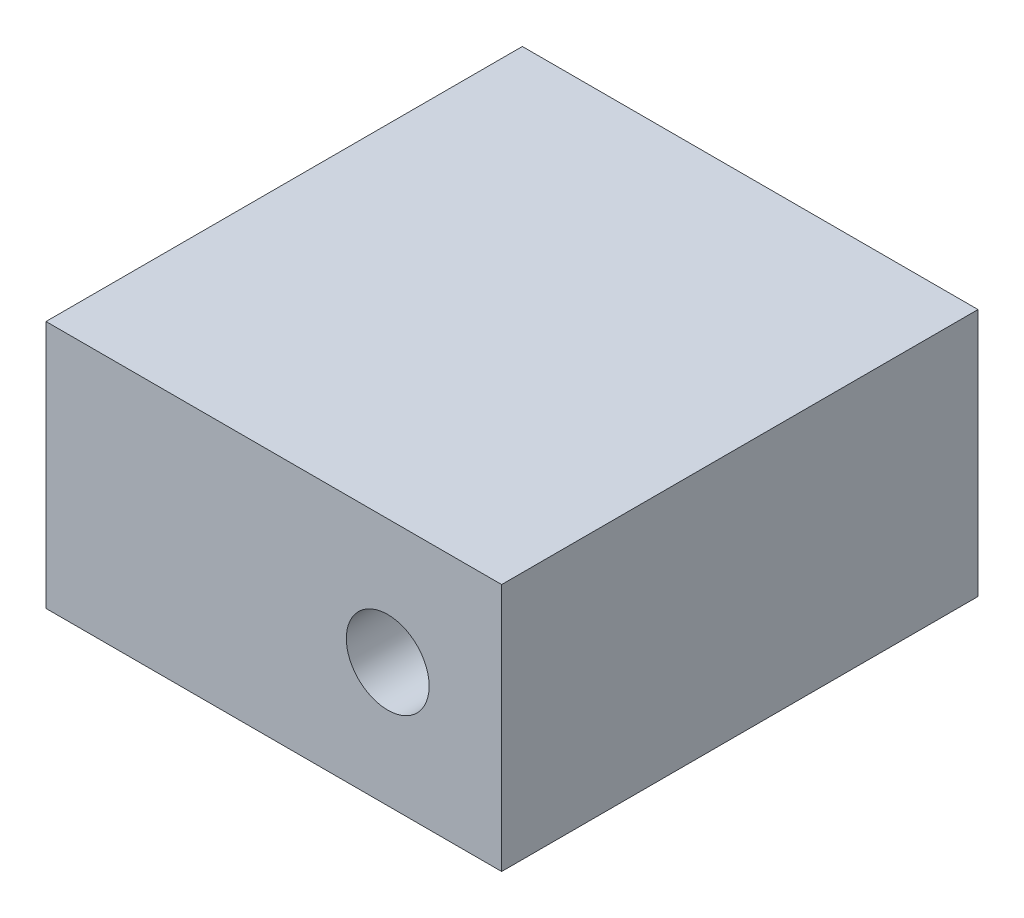
ISO-10303-21;
HEADER;
FILE_DESCRIPTION(('STEP AP214'),'2;1');
FILE_NAME('part.step','',(''),(''),'','','');
FILE_SCHEMA(('AUTOMOTIVE_DESIGN { 1 0 10303 214 1 1 1 1 }'));
ENDSEC;
DATA;
#1=APPLICATION_CONTEXT('core data for automotive mechanical design processes');
#2=APPLICATION_PROTOCOL_DEFINITION('international standard','automotive_design',2000,#1);
#3=PRODUCT_CONTEXT('',#1,'mechanical');
#4=PRODUCT('Part','Part','',(#3));
#5=PRODUCT_RELATED_PRODUCT_CATEGORY('part','',(#4));
#6=PRODUCT_DEFINITION_FORMATION('','',#4);
#7=PRODUCT_DEFINITION_CONTEXT('part definition',#1,'design');
#8=PRODUCT_DEFINITION('design','',#6,#7);
#9=PRODUCT_DEFINITION_SHAPE('','',#8);
#10=(LENGTH_UNIT() NAMED_UNIT(*) SI_UNIT(.MILLI.,.METRE.));
#11=(NAMED_UNIT(*) PLANE_ANGLE_UNIT() SI_UNIT($,.RADIAN.));
#12=(NAMED_UNIT(*) SI_UNIT($,.STERADIAN.) SOLID_ANGLE_UNIT());
#13=UNCERTAINTY_MEASURE_WITH_UNIT(LENGTH_MEASURE(1.E-05),#10,'distance_accuracy_value','');
#14=(GEOMETRIC_REPRESENTATION_CONTEXT(3) GLOBAL_UNCERTAINTY_ASSIGNED_CONTEXT((#13)) GLOBAL_UNIT_ASSIGNED_CONTEXT((#10,
#11,#12)) REPRESENTATION_CONTEXT('',''));
#15=CARTESIAN_POINT('',(0.,0.,0.));
#16=DIRECTION('',(0.,0.,1.));
#17=DIRECTION('',(1.,0.,0.));
#18=AXIS2_PLACEMENT_3D('',#15,#16,#17);
#19=CARTESIAN_POINT('',(0.,0.,23.));
#20=DIRECTION('',(1.,0.,0.));
#21=DIRECTION('',(0.,0.,-1.));
#22=AXIS2_PLACEMENT_3D('',#19,#20,#21);
#23=PLANE('',#22);
#24=DIRECTION('',(0.,-1.,0.));
#25=VECTOR('',#24,1.);
#26=CARTESIAN_POINT('',(0.,0.,0.));
#27=LINE('',#26,#25);
#28=CARTESIAN_POINT('',(0.,12.,0.));
#29=VERTEX_POINT('',#28);
#30=CARTESIAN_POINT('',(0.,0.,0.));
#31=VERTEX_POINT('',#30);
#32=EDGE_CURVE('E98',#29,#31,#27,.T.);
#33=ORIENTED_EDGE('',*,*,#32,.T.);
#34=DIRECTION('',(0.,0.,-1.));
#35=VECTOR('',#34,1.);
#36=CARTESIAN_POINT('',(0.,0.,23.));
#37=LINE('',#36,#35);
#38=CARTESIAN_POINT('',(0.,0.,23.));
#39=VERTEX_POINT('',#38);
#40=EDGE_CURVE('E11',#39,#31,#37,.T.);
#41=ORIENTED_EDGE('',*,*,#40,.F.);
#42=DIRECTION('',(0.,-1.,0.));
#43=VECTOR('',#42,1.);
#44=CARTESIAN_POINT('',(0.,0.,23.));
#45=LINE('',#44,#43);
#46=CARTESIAN_POINT('',(0.,12.,23.));
#47=VERTEX_POINT('',#46);
#48=EDGE_CURVE('E86',#47,#39,#45,.T.);
#49=ORIENTED_EDGE('',*,*,#48,.F.);
#50=DIRECTION('',(0.,0.,-1.));
#51=VECTOR('',#50,1.);
#52=CARTESIAN_POINT('',(0.,12.,23.));
#53=LINE('',#52,#51);
#54=EDGE_CURVE('E94',#47,#29,#53,.T.);
#55=ORIENTED_EDGE('',*,*,#54,.T.);
#56=EDGE_LOOP('',(#33,#41,#49,#55));
#57=FACE_BOUND('',#56,.T.);
#58=ADVANCED_FACE('F35',(#57),#23,.F.);
#59=CARTESIAN_POINT('',(0.,0.,23.));
#60=DIRECTION('',(0.,1.,0.));
#61=DIRECTION('',(0.,0.,1.));
#62=AXIS2_PLACEMENT_3D('',#59,#60,#61);
#63=PLANE('',#62);
#64=DIRECTION('',(1.,0.,0.));
#65=VECTOR('',#64,1.);
#66=CARTESIAN_POINT('',(0.,0.,0.));
#67=LINE('',#66,#65);
#68=CARTESIAN_POINT('',(22.,0.,0.));
#69=VERTEX_POINT('',#68);
#70=EDGE_CURVE('E90',#31,#69,#67,.T.);
#71=ORIENTED_EDGE('',*,*,#70,.T.);
#72=DIRECTION('',(0.,0.,-1.));
#73=VECTOR('',#72,1.);
#74=CARTESIAN_POINT('',(22.,0.,23.));
#75=LINE('',#74,#73);
#76=CARTESIAN_POINT('',(22.,0.,23.));
#77=VERTEX_POINT('',#76);
#78=EDGE_CURVE('E43',#77,#69,#75,.T.);
#79=ORIENTED_EDGE('',*,*,#78,.F.);
#80=DIRECTION('',(1.,0.,0.));
#81=VECTOR('',#80,1.);
#82=CARTESIAN_POINT('',(0.,0.,23.));
#83=LINE('',#82,#81);
#84=EDGE_CURVE('E81',#39,#77,#83,.T.);
#85=ORIENTED_EDGE('',*,*,#84,.F.);
#86=ORIENTED_EDGE('',*,*,#40,.T.);
#87=EDGE_LOOP('',(#71,#79,#85,#86));
#88=FACE_BOUND('',#87,.T.);
#89=ADVANCED_FACE('F89',(#88),#63,.F.);
#90=CARTESIAN_POINT('',(22.,0.,23.));
#91=DIRECTION('',(-1.,0.,0.));
#92=DIRECTION('',(0.,0.,1.));
#93=AXIS2_PLACEMENT_3D('',#90,#91,#92);
#94=PLANE('',#93);
#95=DIRECTION('',(0.,1.,0.));
#96=VECTOR('',#95,1.);
#97=CARTESIAN_POINT('',(22.,0.,0.));
#98=LINE('',#97,#96);
#99=CARTESIAN_POINT('',(22.,12.,0.));
#100=VERTEX_POINT('',#99);
#101=EDGE_CURVE('E68',#69,#100,#98,.T.);
#102=ORIENTED_EDGE('',*,*,#101,.T.);
#103=DIRECTION('',(0.,0.,-1.));
#104=VECTOR('',#103,1.);
#105=CARTESIAN_POINT('',(22.,12.,23.));
#106=LINE('',#105,#104);
#107=CARTESIAN_POINT('',(22.,12.,23.));
#108=VERTEX_POINT('',#107);
#109=EDGE_CURVE('E91',#108,#100,#106,.T.);
#110=ORIENTED_EDGE('',*,*,#109,.F.);
#111=DIRECTION('',(0.,1.,0.));
#112=VECTOR('',#111,1.);
#113=CARTESIAN_POINT('',(22.,0.,23.));
#114=LINE('',#113,#112);
#115=EDGE_CURVE('E84',#77,#108,#114,.T.);
#116=ORIENTED_EDGE('',*,*,#115,.F.);
#117=ORIENTED_EDGE('',*,*,#78,.T.);
#118=EDGE_LOOP('',(#102,#110,#116,#117));
#119=FACE_BOUND('',#118,.T.);
#120=ADVANCED_FACE('F92',(#119),#94,.F.);
#121=CARTESIAN_POINT('',(0.,12.,23.));
#122=DIRECTION('',(0.,-1.,0.));
#123=DIRECTION('',(0.,0.,-1.));
#124=AXIS2_PLACEMENT_3D('',#121,#122,#123);
#125=PLANE('',#124);
#126=DIRECTION('',(-1.,0.,0.));
#127=VECTOR('',#126,1.);
#128=CARTESIAN_POINT('',(0.,12.,0.));
#129=LINE('',#128,#127);
#130=EDGE_CURVE('E74',#100,#29,#129,.T.);
#131=ORIENTED_EDGE('',*,*,#130,.T.);
#132=ORIENTED_EDGE('',*,*,#54,.F.);
#133=DIRECTION('',(-1.,0.,0.));
#134=VECTOR('',#133,1.);
#135=CARTESIAN_POINT('',(0.,12.,23.));
#136=LINE('',#135,#134);
#137=EDGE_CURVE('E51',#108,#47,#136,.T.);
#138=ORIENTED_EDGE('',*,*,#137,.F.);
#139=ORIENTED_EDGE('',*,*,#109,.T.);
#140=EDGE_LOOP('',(#131,#132,#138,#139));
#141=FACE_BOUND('',#140,.T.);
#142=ADVANCED_FACE('F106',(#141),#125,.F.);
#143=CARTESIAN_POINT('',(0.,0.,23.));
#144=DIRECTION('',(0.,0.,-1.));
#145=DIRECTION('',(-1.,0.,0.));
#146=AXIS2_PLACEMENT_3D('',#143,#144,#145);
#147=PLANE('',#146);
#148=CARTESIAN_POINT('',(16.5,6.,23.));
#149=DIRECTION('',(0.,0.,1.));
#150=DIRECTION('',(1.,0.,0.));
#151=AXIS2_PLACEMENT_3D('',#148,#149,#150);
#152=CIRCLE('',#151,2.);
#153=CARTESIAN_POINT('',(18.5,6.,23.));
#154=VERTEX_POINT('',#153);
#155=EDGE_CURVE('E112',#154,#154,#152,.T.);
#156=ORIENTED_EDGE('',*,*,#155,.F.);
#157=EDGE_LOOP('',(#156));
#158=FACE_BOUND('',#157,.T.);
#159=ORIENTED_EDGE('',*,*,#48,.T.);
#160=ORIENTED_EDGE('',*,*,#84,.T.);
#161=ORIENTED_EDGE('',*,*,#115,.T.);
#162=ORIENTED_EDGE('',*,*,#137,.T.);
#163=EDGE_LOOP('',(#159,#160,#161,#162));
#164=FACE_BOUND('',#163,.T.);
#165=ADVANCED_FACE('F82',(#158,#164),#147,.F.);
#166=CARTESIAN_POINT('',(0.,0.,0.));
#167=DIRECTION('',(0.,0.,-1.));
#168=DIRECTION('',(-1.,0.,0.));
#169=AXIS2_PLACEMENT_3D('',#166,#167,#168);
#170=PLANE('',#169);
#171=ORIENTED_EDGE('',*,*,#32,.F.);
#172=ORIENTED_EDGE('',*,*,#130,.F.);
#173=ORIENTED_EDGE('',*,*,#101,.F.);
#174=ORIENTED_EDGE('',*,*,#70,.F.);
#175=EDGE_LOOP('',(#171,#172,#173,#174));
#176=FACE_BOUND('',#175,.T.);
#177=ADVANCED_FACE('F109',(#176),#170,.T.);
#178=CARTESIAN_POINT('',(16.5,6.,12.));
#179=DIRECTION('',(0.,0.,1.));
#180=DIRECTION('',(1.,0.,0.));
#181=AXIS2_PLACEMENT_3D('',#178,#179,#180);
#182=CYLINDRICAL_SURFACE('',#181,2.);
#183=CARTESIAN_POINT('',(16.5,6.,12.));
#184=DIRECTION('',(0.,0.,1.));
#185=DIRECTION('',(1.,0.,0.));
#186=AXIS2_PLACEMENT_3D('',#183,#184,#185);
#187=CIRCLE('',#186,2.);
#188=CARTESIAN_POINT('',(18.5,6.,12.));
#189=VERTEX_POINT('',#188);
#190=EDGE_CURVE('E101',#189,#189,#187,.T.);
#191=ORIENTED_EDGE('',*,*,#190,.F.);
#192=EDGE_LOOP('',(#191));
#193=FACE_BOUND('',#192,.T.);
#194=ORIENTED_EDGE('',*,*,#155,.T.);
#195=EDGE_LOOP('',(#194));
#196=FACE_BOUND('',#195,.T.);
#197=ADVANCED_FACE('F120',(#193,#196),#182,.F.);
#198=CARTESIAN_POINT('',(16.5,6.,12.));
#199=DIRECTION('',(0.,0.,1.));
#200=DIRECTION('',(1.,0.,0.));
#201=AXIS2_PLACEMENT_3D('',#198,#199,#200);
#202=PLANE('',#201);
#203=ORIENTED_EDGE('',*,*,#190,.T.);
#204=EDGE_LOOP('',(#203));
#205=FACE_BOUND('',#204,.T.);
#206=ADVANCED_FACE('F118',(#205),#202,.T.);
#207=CLOSED_SHELL('',(#58,#89,#120,#142,#165,#177,#197,#206));
#208=MANIFOLD_SOLID_BREP('B2',#207);
#209=ADVANCED_BREP_SHAPE_REPRESENTATION('',(#18,#208),#14);
#210=SHAPE_DEFINITION_REPRESENTATION(#9,#209);
ENDSEC;
END-ISO-10303-21;
